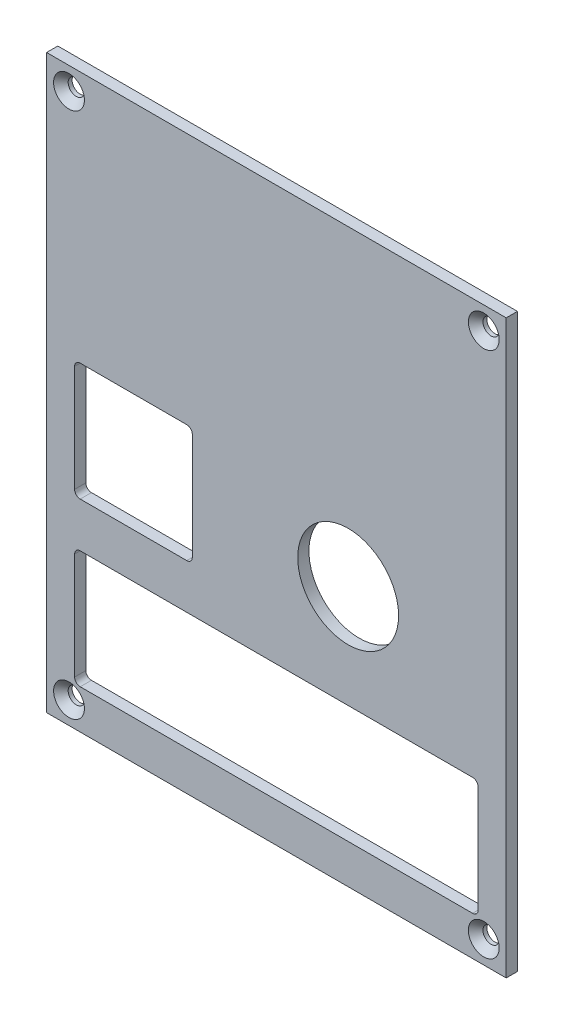
ISO-10303-21;
HEADER;
FILE_DESCRIPTION(('STEP AP214'),'2;1');
FILE_NAME('part.step','',(''),(''),'','','');
FILE_SCHEMA(('AUTOMOTIVE_DESIGN { 1 0 10303 214 1 1 1 1 }'));
ENDSEC;
DATA;
#1=APPLICATION_CONTEXT('core data for automotive mechanical design processes');
#2=APPLICATION_PROTOCOL_DEFINITION('international standard','automotive_design',2000,#1);
#3=PRODUCT_CONTEXT('',#1,'mechanical');
#4=PRODUCT('Part','Part','',(#3));
#5=PRODUCT_RELATED_PRODUCT_CATEGORY('part','',(#4));
#6=PRODUCT_DEFINITION_FORMATION('','',#4);
#7=PRODUCT_DEFINITION_CONTEXT('part definition',#1,'design');
#8=PRODUCT_DEFINITION('design','',#6,#7);
#9=PRODUCT_DEFINITION_SHAPE('','',#8);
#10=(LENGTH_UNIT() NAMED_UNIT(*) SI_UNIT(.MILLI.,.METRE.));
#11=(NAMED_UNIT(*) PLANE_ANGLE_UNIT() SI_UNIT($,.RADIAN.));
#12=(NAMED_UNIT(*) SI_UNIT($,.STERADIAN.) SOLID_ANGLE_UNIT());
#13=UNCERTAINTY_MEASURE_WITH_UNIT(LENGTH_MEASURE(1.E-05),#10,'distance_accuracy_value','');
#14=(GEOMETRIC_REPRESENTATION_CONTEXT(3) GLOBAL_UNCERTAINTY_ASSIGNED_CONTEXT((#13)) GLOBAL_UNIT_ASSIGNED_CONTEXT((#10,
#11,#12)) REPRESENTATION_CONTEXT('',''));
#15=CARTESIAN_POINT('',(0.,0.,0.));
#16=DIRECTION('',(0.,0.,1.));
#17=DIRECTION('',(1.,0.,0.));
#18=AXIS2_PLACEMENT_3D('',#15,#16,#17);
#19=CARTESIAN_POINT('',(-49.4982229940401,55.7269024568216,2.));
#20=DIRECTION('',(1.,0.,0.));
#21=DIRECTION('',(0.,1.,0.));
#22=AXIS2_PLACEMENT_3D('',#19,#20,#21);
#23=PLANE('',#22);
#24=DIRECTION('',(0.,-1.,0.));
#25=VECTOR('',#24,1.);
#26=CARTESIAN_POINT('',(-49.4982229940401,55.7269024568216,0.));
#27=LINE('',#26,#25);
#28=CARTESIAN_POINT('',(-49.4982229940401,55.7269024568216,0.));
#29=VERTEX_POINT('',#28);
#30=CARTESIAN_POINT('',(-49.4982229940401,-46.2730975431784,0.));
#31=VERTEX_POINT('',#30);
#32=EDGE_CURVE('E237',#29,#31,#27,.T.);
#33=ORIENTED_EDGE('',*,*,#32,.T.);
#34=DIRECTION('',(0.,0.,-1.));
#35=VECTOR('',#34,1.);
#36=CARTESIAN_POINT('',(-49.4982229940401,-46.2730975431784,2.));
#37=LINE('',#36,#35);
#38=CARTESIAN_POINT('',(-49.4982229940401,-46.2730975431784,2.));
#39=VERTEX_POINT('',#38);
#40=EDGE_CURVE('E11',#39,#31,#37,.T.);
#41=ORIENTED_EDGE('',*,*,#40,.F.);
#42=DIRECTION('',(0.,-1.,0.));
#43=VECTOR('',#42,1.);
#44=CARTESIAN_POINT('',(-49.4982229940401,55.7269024568216,2.));
#45=LINE('',#44,#43);
#46=CARTESIAN_POINT('',(-49.4982229940401,55.7269024568216,2.));
#47=VERTEX_POINT('',#46);
#48=EDGE_CURVE('E316',#47,#39,#45,.T.);
#49=ORIENTED_EDGE('',*,*,#48,.F.);
#50=DIRECTION('',(0.,0.,-1.));
#51=VECTOR('',#50,1.);
#52=CARTESIAN_POINT('',(-49.4982229940401,55.7269024568216,2.));
#53=LINE('',#52,#51);
#54=EDGE_CURVE('E326',#47,#29,#53,.T.);
#55=ORIENTED_EDGE('',*,*,#54,.T.);
#56=EDGE_LOOP('',(#33,#41,#49,#55));
#57=FACE_BOUND('',#56,.T.);
#58=ADVANCED_FACE('F37',(#57),#23,.F.);
#59=CARTESIAN_POINT('',(-49.4982229940401,-46.2730975431784,2.));
#60=DIRECTION('',(0.,1.,0.));
#61=DIRECTION('',(0.,0.,1.));
#62=AXIS2_PLACEMENT_3D('',#59,#60,#61);
#63=PLANE('',#62);
#64=DIRECTION('',(1.,0.,0.));
#65=VECTOR('',#64,1.);
#66=CARTESIAN_POINT('',(-49.4982229940401,-46.2730975431784,0.));
#67=LINE('',#66,#65);
#68=CARTESIAN_POINT('',(32.5017770059599,-46.2730975431784,0.));
#69=VERTEX_POINT('',#68);
#70=EDGE_CURVE('E329',#31,#69,#67,.T.);
#71=ORIENTED_EDGE('',*,*,#70,.T.);
#72=DIRECTION('',(0.,0.,-1.));
#73=VECTOR('',#72,1.);
#74=CARTESIAN_POINT('',(32.5017770059599,-46.2730975431784,2.));
#75=LINE('',#74,#73);
#76=CARTESIAN_POINT('',(32.5017770059599,-46.2730975431784,2.));
#77=VERTEX_POINT('',#76);
#78=EDGE_CURVE('E44',#77,#69,#75,.T.);
#79=ORIENTED_EDGE('',*,*,#78,.F.);
#80=DIRECTION('',(1.,0.,0.));
#81=VECTOR('',#80,1.);
#82=CARTESIAN_POINT('',(-49.4982229940401,-46.2730975431784,2.));
#83=LINE('',#82,#81);
#84=EDGE_CURVE('E319',#39,#77,#83,.T.);
#85=ORIENTED_EDGE('',*,*,#84,.F.);
#86=ORIENTED_EDGE('',*,*,#40,.T.);
#87=EDGE_LOOP('',(#71,#79,#85,#86));
#88=FACE_BOUND('',#87,.T.);
#89=ADVANCED_FACE('F358',(#88),#63,.F.);
#90=CARTESIAN_POINT('',(32.5017770059599,55.7269024568216,2.));
#91=DIRECTION('',(-1.,0.,0.));
#92=DIRECTION('',(0.,-1.,0.));
#93=AXIS2_PLACEMENT_3D('',#90,#91,#92);
#94=PLANE('',#93);
#95=DIRECTION('',(0.,1.,0.));
#96=VECTOR('',#95,1.);
#97=CARTESIAN_POINT('',(32.5017770059599,55.7269024568216,0.));
#98=LINE('',#97,#96);
#99=CARTESIAN_POINT('',(32.5017770059599,55.7269024568216,0.));
#100=VERTEX_POINT('',#99);
#101=EDGE_CURVE('E331',#69,#100,#98,.T.);
#102=ORIENTED_EDGE('',*,*,#101,.T.);
#103=DIRECTION('',(0.,0.,-1.));
#104=VECTOR('',#103,1.);
#105=CARTESIAN_POINT('',(32.5017770059599,55.7269024568216,2.));
#106=LINE('',#105,#104);
#107=CARTESIAN_POINT('',(32.5017770059599,55.7269024568216,2.));
#108=VERTEX_POINT('',#107);
#109=EDGE_CURVE('E336',#108,#100,#106,.T.);
#110=ORIENTED_EDGE('',*,*,#109,.F.);
#111=DIRECTION('',(0.,1.,0.));
#112=VECTOR('',#111,1.);
#113=CARTESIAN_POINT('',(32.5017770059599,55.7269024568216,2.));
#114=LINE('',#113,#112);
#115=EDGE_CURVE('E322',#77,#108,#114,.T.);
#116=ORIENTED_EDGE('',*,*,#115,.F.);
#117=ORIENTED_EDGE('',*,*,#78,.T.);
#118=EDGE_LOOP('',(#102,#110,#116,#117));
#119=FACE_BOUND('',#118,.T.);
#120=ADVANCED_FACE('F343',(#119),#94,.F.);
#121=CARTESIAN_POINT('',(-49.4982229940401,55.7269024568216,2.));
#122=DIRECTION('',(0.,-1.,0.));
#123=DIRECTION('',(0.,0.,-1.));
#124=AXIS2_PLACEMENT_3D('',#121,#122,#123);
#125=PLANE('',#124);
#126=DIRECTION('',(-1.,0.,0.));
#127=VECTOR('',#126,1.);
#128=CARTESIAN_POINT('',(-49.4982229940401,55.7269024568216,0.));
#129=LINE('',#128,#127);
#130=EDGE_CURVE('E320',#100,#29,#129,.T.);
#131=ORIENTED_EDGE('',*,*,#130,.T.);
#132=ORIENTED_EDGE('',*,*,#54,.F.);
#133=DIRECTION('',(-1.,0.,0.));
#134=VECTOR('',#133,1.);
#135=CARTESIAN_POINT('',(-49.4982229940401,55.7269024568216,2.));
#136=LINE('',#135,#134);
#137=EDGE_CURVE('E324',#108,#47,#136,.T.);
#138=ORIENTED_EDGE('',*,*,#137,.F.);
#139=ORIENTED_EDGE('',*,*,#109,.T.);
#140=EDGE_LOOP('',(#131,#132,#138,#139));
#141=FACE_BOUND('',#140,.T.);
#142=ADVANCED_FACE('F351',(#141),#125,.F.);
#143=CARTESIAN_POINT('',(0.,0.,2.));
#144=DIRECTION('',(0.,0.,1.));
#145=DIRECTION('',(1.,0.,0.));
#146=AXIS2_PLACEMENT_3D('',#143,#144,#145);
#147=PLANE('',#146);
#148=CARTESIAN_POINT('',(-45.4982229940401,51.7269024568216,2.));
#149=DIRECTION('',(0.,0.,1.));
#150=DIRECTION('',(1.,0.,0.));
#151=AXIS2_PLACEMENT_3D('',#148,#149,#150);
#152=CIRCLE('',#151,2.75);
#153=CARTESIAN_POINT('',(-42.7482229940401,51.7269024568216,2.));
#154=VERTEX_POINT('',#153);
#155=EDGE_CURVE('E476',#154,#154,#152,.T.);
#156=ORIENTED_EDGE('',*,*,#155,.F.);
#157=EDGE_LOOP('',(#156));
#158=FACE_BOUND('',#157,.T.);
#159=CARTESIAN_POINT('',(-45.4982229940401,-42.2730975431784,2.));
#160=DIRECTION('',(0.,0.,1.));
#161=DIRECTION('',(1.,0.,0.));
#162=AXIS2_PLACEMENT_3D('',#159,#160,#161);
#163=CIRCLE('',#162,2.75);
#164=CARTESIAN_POINT('',(-42.7482229940401,-42.2730975431784,2.));
#165=VERTEX_POINT('',#164);
#166=EDGE_CURVE('E483',#165,#165,#163,.T.);
#167=ORIENTED_EDGE('',*,*,#166,.F.);
#168=EDGE_LOOP('',(#167));
#169=FACE_BOUND('',#168,.T.);
#170=CARTESIAN_POINT('',(28.5017770059599,-42.2730975431784,2.));
#171=DIRECTION('',(0.,0.,1.));
#172=DIRECTION('',(1.,0.,0.));
#173=AXIS2_PLACEMENT_3D('',#170,#171,#172);
#174=CIRCLE('',#173,2.75);
#175=CARTESIAN_POINT('',(31.2517770059599,-42.2730975431784,2.));
#176=VERTEX_POINT('',#175);
#177=EDGE_CURVE('E492',#176,#176,#174,.T.);
#178=ORIENTED_EDGE('',*,*,#177,.F.);
#179=EDGE_LOOP('',(#178));
#180=FACE_BOUND('',#179,.T.);
#181=CARTESIAN_POINT('',(28.5017770059599,51.7269024568216,2.));
#182=DIRECTION('',(0.,0.,1.));
#183=DIRECTION('',(1.,0.,0.));
#184=AXIS2_PLACEMENT_3D('',#181,#182,#183);
#185=CIRCLE('',#184,2.75);
#186=CARTESIAN_POINT('',(31.2517770059599,51.7269024568216,2.));
#187=VERTEX_POINT('',#186);
#188=EDGE_CURVE('E501',#187,#187,#185,.T.);
#189=ORIENTED_EDGE('',*,*,#188,.F.);
#190=EDGE_LOOP('',(#189));
#191=FACE_BOUND('',#190,.T.);
#192=CARTESIAN_POINT('',(26.5017770059599,-19.2730975431784,2.));
#193=DIRECTION('',(0.,0.,1.));
#194=DIRECTION('',(-1.,0.,0.));
#195=AXIS2_PLACEMENT_3D('',#192,#193,#194);
#196=CIRCLE('',#195,1.);
#197=CARTESIAN_POINT('',(27.5017770059599,-19.2730975431784,2.));
#198=VERTEX_POINT('',#197);
#199=CARTESIAN_POINT('',(26.5017770059599,-18.2730975431784,2.));
#200=VERTEX_POINT('',#199);
#201=EDGE_CURVE('E51',#198,#200,#196,.T.);
#202=ORIENTED_EDGE('',*,*,#201,.F.);
#203=DIRECTION('',(0.,1.,0.));
#204=VECTOR('',#203,1.);
#205=CARTESIAN_POINT('',(27.5017770059599,-19.2730975431784,2.));
#206=LINE('',#205,#204);
#207=CARTESIAN_POINT('',(27.5017770059599,-38.2730975431784,2.));
#208=VERTEX_POINT('',#207);
#209=EDGE_CURVE('E195',#208,#198,#206,.T.);
#210=ORIENTED_EDGE('',*,*,#209,.F.);
#211=CARTESIAN_POINT('',(26.5017770059599,-38.2730975431784,2.));
#212=DIRECTION('',(0.,0.,1.));
#213=DIRECTION('',(1.,0.,0.));
#214=AXIS2_PLACEMENT_3D('',#211,#212,#213);
#215=CIRCLE('',#214,1.);
#216=CARTESIAN_POINT('',(26.5017770059599,-39.2730975431784,2.));
#217=VERTEX_POINT('',#216);
#218=EDGE_CURVE('E198',#217,#208,#215,.T.);
#219=ORIENTED_EDGE('',*,*,#218,.F.);
#220=DIRECTION('',(1.,0.,0.));
#221=VECTOR('',#220,1.);
#222=CARTESIAN_POINT('',(-43.4982229940401,-39.2730975431784,2.));
#223=LINE('',#222,#221);
#224=CARTESIAN_POINT('',(-43.4982229940401,-39.2730975431784,2.));
#225=VERTEX_POINT('',#224);
#226=EDGE_CURVE('E230',#225,#217,#223,.T.);
#227=ORIENTED_EDGE('',*,*,#226,.F.);
#228=CARTESIAN_POINT('',(-43.4982229940401,-38.2730975431784,2.));
#229=DIRECTION('',(0.,0.,1.));
#230=DIRECTION('',(1.,0.,0.));
#231=AXIS2_PLACEMENT_3D('',#228,#229,#230);
#232=CIRCLE('',#231,1.);
#233=CARTESIAN_POINT('',(-44.4982229940401,-38.2730975431784,2.));
#234=VERTEX_POINT('',#233);
#235=EDGE_CURVE('E227',#234,#225,#232,.T.);
#236=ORIENTED_EDGE('',*,*,#235,.F.);
#237=DIRECTION('',(0.,-1.,0.));
#238=VECTOR('',#237,1.);
#239=CARTESIAN_POINT('',(-44.4982229940401,-19.2730975431784,2.));
#240=LINE('',#239,#238);
#241=CARTESIAN_POINT('',(-44.4982229940401,-19.2730975431784,2.));
#242=VERTEX_POINT('',#241);
#243=EDGE_CURVE('E224',#242,#234,#240,.T.);
#244=ORIENTED_EDGE('',*,*,#243,.F.);
#245=CARTESIAN_POINT('',(-43.4982229940401,-19.2730975431784,2.));
#246=DIRECTION('',(0.,0.,1.));
#247=DIRECTION('',(1.,0.,0.));
#248=AXIS2_PLACEMENT_3D('',#245,#246,#247);
#249=CIRCLE('',#248,1.);
#250=CARTESIAN_POINT('',(-43.4982229940401,-18.2730975431784,2.));
#251=VERTEX_POINT('',#250);
#252=EDGE_CURVE('E221',#251,#242,#249,.T.);
#253=ORIENTED_EDGE('',*,*,#252,.F.);
#254=DIRECTION('',(-1.,0.,0.));
#255=VECTOR('',#254,1.);
#256=CARTESIAN_POINT('',(-43.4982229940401,-18.2730975431784,2.));
#257=LINE('',#256,#255);
#258=EDGE_CURVE('E218',#200,#251,#257,.T.);
#259=ORIENTED_EDGE('',*,*,#258,.F.);
#260=EDGE_LOOP('',(#202,#210,#219,#227,#236,#244,#253,#259));
#261=FACE_BOUND('',#260,.T.);
#262=CARTESIAN_POINT('',(-43.4982229940401,-9.27309754317841,2.));
#263=DIRECTION('',(0.,0.,1.));
#264=DIRECTION('',(1.,0.,0.));
#265=AXIS2_PLACEMENT_3D('',#262,#263,#264);
#266=CIRCLE('',#265,1.);
#267=CARTESIAN_POINT('',(-44.4982229940401,-9.27309754317841,2.));
#268=VERTEX_POINT('',#267);
#269=CARTESIAN_POINT('',(-43.4982229940401,-10.2730975431784,2.));
#270=VERTEX_POINT('',#269);
#271=EDGE_CURVE('E59',#268,#270,#266,.T.);
#272=ORIENTED_EDGE('',*,*,#271,.F.);
#273=DIRECTION('',(0.,-1.,0.));
#274=VECTOR('',#273,1.);
#275=CARTESIAN_POINT('',(-44.4982229940401,9.72690245682159,2.));
#276=LINE('',#275,#274);
#277=CARTESIAN_POINT('',(-44.4982229940401,9.72690245682159,2.));
#278=VERTEX_POINT('',#277);
#279=EDGE_CURVE('E253',#278,#268,#276,.T.);
#280=ORIENTED_EDGE('',*,*,#279,.F.);
#281=CARTESIAN_POINT('',(-43.4982229940401,9.72690245682159,2.));
#282=DIRECTION('',(0.,0.,1.));
#283=DIRECTION('',(1.,0.,0.));
#284=AXIS2_PLACEMENT_3D('',#281,#282,#283);
#285=CIRCLE('',#284,1.);
#286=CARTESIAN_POINT('',(-43.4982229940401,10.7269024568216,2.));
#287=VERTEX_POINT('',#286);
#288=EDGE_CURVE('E292',#287,#278,#285,.T.);
#289=ORIENTED_EDGE('',*,*,#288,.F.);
#290=DIRECTION('',(-1.,0.,0.));
#291=VECTOR('',#290,1.);
#292=CARTESIAN_POINT('',(-43.4982229940401,10.7269024568216,2.));
#293=LINE('',#292,#291);
#294=CARTESIAN_POINT('',(-24.4982229940401,10.7269024568216,2.));
#295=VERTEX_POINT('',#294);
#296=EDGE_CURVE('E289',#295,#287,#293,.T.);
#297=ORIENTED_EDGE('',*,*,#296,.F.);
#298=CARTESIAN_POINT('',(-24.4982229940401,9.72690245682159,2.));
#299=DIRECTION('',(0.,0.,1.));
#300=DIRECTION('',(-1.,0.,0.));
#301=AXIS2_PLACEMENT_3D('',#298,#299,#300);
#302=CIRCLE('',#301,1.);
#303=CARTESIAN_POINT('',(-23.4982229940401,9.72690245682159,2.));
#304=VERTEX_POINT('',#303);
#305=EDGE_CURVE('E286',#304,#295,#302,.T.);
#306=ORIENTED_EDGE('',*,*,#305,.F.);
#307=DIRECTION('',(0.,1.,0.));
#308=VECTOR('',#307,1.);
#309=CARTESIAN_POINT('',(-23.4982229940401,9.72690245682159,2.));
#310=LINE('',#309,#308);
#311=CARTESIAN_POINT('',(-23.4982229940401,-9.27309754317841,2.));
#312=VERTEX_POINT('',#311);
#313=EDGE_CURVE('E283',#312,#304,#310,.T.);
#314=ORIENTED_EDGE('',*,*,#313,.F.);
#315=CARTESIAN_POINT('',(-24.4982229940401,-9.27309754317841,2.));
#316=DIRECTION('',(0.,0.,1.));
#317=DIRECTION('',(1.,0.,0.));
#318=AXIS2_PLACEMENT_3D('',#315,#316,#317);
#319=CIRCLE('',#318,1.);
#320=CARTESIAN_POINT('',(-24.4982229940401,-10.2730975431784,2.));
#321=VERTEX_POINT('',#320);
#322=EDGE_CURVE('E280',#321,#312,#319,.T.);
#323=ORIENTED_EDGE('',*,*,#322,.F.);
#324=DIRECTION('',(1.,0.,0.));
#325=VECTOR('',#324,1.);
#326=CARTESIAN_POINT('',(-43.4982229940401,-10.2730975431784,2.));
#327=LINE('',#326,#325);
#328=EDGE_CURVE('E276',#270,#321,#327,.T.);
#329=ORIENTED_EDGE('',*,*,#328,.F.);
#330=EDGE_LOOP('',(#272,#280,#289,#297,#306,#314,#323,#329));
#331=FACE_BOUND('',#330,.T.);
#332=CARTESIAN_POINT('',(4.30178163771792,0.112195323661565,2.));
#333=DIRECTION('',(0.,0.,1.));
#334=DIRECTION('',(1.,0.,0.));
#335=AXIS2_PLACEMENT_3D('',#332,#333,#334);
#336=CIRCLE('',#335,9.00000000000094);
#337=CARTESIAN_POINT('',(13.3017816377189,0.112195323661565,2.));
#338=VERTEX_POINT('',#337);
#339=EDGE_CURVE('E313',#338,#338,#336,.T.);
#340=ORIENTED_EDGE('',*,*,#339,.F.);
#341=EDGE_LOOP('',(#340));
#342=FACE_BOUND('',#341,.T.);
#343=ORIENTED_EDGE('',*,*,#48,.T.);
#344=ORIENTED_EDGE('',*,*,#84,.T.);
#345=ORIENTED_EDGE('',*,*,#115,.T.);
#346=ORIENTED_EDGE('',*,*,#137,.T.);
#347=EDGE_LOOP('',(#343,#344,#345,#346));
#348=FACE_BOUND('',#347,.T.);
#349=ADVANCED_FACE('F357',(#158,#169,#180,#191,#261,#331,#342,#348),#147,.T.);
#350=CARTESIAN_POINT('',(0.,0.,0.));
#351=DIRECTION('',(0.,0.,1.));
#352=DIRECTION('',(1.,0.,0.));
#353=AXIS2_PLACEMENT_3D('',#350,#351,#352);
#354=PLANE('',#353);
#355=CARTESIAN_POINT('',(-45.4982229940401,51.7269024568216,0.));
#356=DIRECTION('',(0.,0.,1.));
#357=DIRECTION('',(1.,0.,0.));
#358=AXIS2_PLACEMENT_3D('',#355,#356,#357);
#359=CIRCLE('',#358,1.45);
#360=CARTESIAN_POINT('',(-44.0482229940401,51.7269024568216,0.));
#361=VERTEX_POINT('',#360);
#362=EDGE_CURVE('E478',#361,#361,#359,.T.);
#363=ORIENTED_EDGE('',*,*,#362,.T.);
#364=EDGE_LOOP('',(#363));
#365=FACE_BOUND('',#364,.T.);
#366=CARTESIAN_POINT('',(-45.4982229940401,-42.2730975431784,0.));
#367=DIRECTION('',(0.,0.,1.));
#368=DIRECTION('',(1.,0.,0.));
#369=AXIS2_PLACEMENT_3D('',#366,#367,#368);
#370=CIRCLE('',#369,1.45);
#371=CARTESIAN_POINT('',(-44.0482229940401,-42.2730975431784,0.));
#372=VERTEX_POINT('',#371);
#373=EDGE_CURVE('E489',#372,#372,#370,.T.);
#374=ORIENTED_EDGE('',*,*,#373,.T.);
#375=EDGE_LOOP('',(#374));
#376=FACE_BOUND('',#375,.T.);
#377=CARTESIAN_POINT('',(28.5017770059599,-42.2730975431784,0.));
#378=DIRECTION('',(0.,0.,1.));
#379=DIRECTION('',(1.,0.,0.));
#380=AXIS2_PLACEMENT_3D('',#377,#378,#379);
#381=CIRCLE('',#380,1.45);
#382=CARTESIAN_POINT('',(29.9517770059599,-42.2730975431784,0.));
#383=VERTEX_POINT('',#382);
#384=EDGE_CURVE('E498',#383,#383,#381,.T.);
#385=ORIENTED_EDGE('',*,*,#384,.T.);
#386=EDGE_LOOP('',(#385));
#387=FACE_BOUND('',#386,.T.);
#388=CARTESIAN_POINT('',(28.5017770059599,51.7269024568216,0.));
#389=DIRECTION('',(0.,0.,1.));
#390=DIRECTION('',(1.,0.,0.));
#391=AXIS2_PLACEMENT_3D('',#388,#389,#390);
#392=CIRCLE('',#391,1.45);
#393=CARTESIAN_POINT('',(29.9517770059599,51.7269024568216,0.));
#394=VERTEX_POINT('',#393);
#395=EDGE_CURVE('E201',#394,#394,#392,.T.);
#396=ORIENTED_EDGE('',*,*,#395,.T.);
#397=EDGE_LOOP('',(#396));
#398=FACE_BOUND('',#397,.T.);
#399=DIRECTION('',(0.,1.,0.));
#400=VECTOR('',#399,1.);
#401=CARTESIAN_POINT('',(27.5017770059599,-19.2730975431784,0.));
#402=LINE('',#401,#400);
#403=CARTESIAN_POINT('',(27.5017770059599,-38.2730975431784,0.));
#404=VERTEX_POINT('',#403);
#405=CARTESIAN_POINT('',(27.5017770059599,-19.2730975431784,0.));
#406=VERTEX_POINT('',#405);
#407=EDGE_CURVE('E181',#404,#406,#402,.T.);
#408=ORIENTED_EDGE('',*,*,#407,.T.);
#409=CARTESIAN_POINT('',(26.5017770059599,-19.2730975431784,0.));
#410=DIRECTION('',(0.,0.,1.));
#411=DIRECTION('',(-1.,0.,0.));
#412=AXIS2_PLACEMENT_3D('',#409,#410,#411);
#413=CIRCLE('',#412,1.);
#414=CARTESIAN_POINT('',(26.5017770059599,-18.2730975431784,0.));
#415=VERTEX_POINT('',#414);
#416=EDGE_CURVE('E175',#406,#415,#413,.T.);
#417=ORIENTED_EDGE('',*,*,#416,.T.);
#418=DIRECTION('',(-1.,0.,0.));
#419=VECTOR('',#418,1.);
#420=CARTESIAN_POINT('',(-43.4982229940401,-18.2730975431784,0.));
#421=LINE('',#420,#419);
#422=CARTESIAN_POINT('',(-43.4982229940401,-18.2730975431784,0.));
#423=VERTEX_POINT('',#422);
#424=EDGE_CURVE('E185',#415,#423,#421,.T.);
#425=ORIENTED_EDGE('',*,*,#424,.T.);
#426=CARTESIAN_POINT('',(-43.4982229940401,-19.2730975431784,0.));
#427=DIRECTION('',(0.,0.,1.));
#428=DIRECTION('',(1.,0.,0.));
#429=AXIS2_PLACEMENT_3D('',#426,#427,#428);
#430=CIRCLE('',#429,1.);
#431=CARTESIAN_POINT('',(-44.4982229940401,-19.2730975431784,0.));
#432=VERTEX_POINT('',#431);
#433=EDGE_CURVE('E189',#423,#432,#430,.T.);
#434=ORIENTED_EDGE('',*,*,#433,.T.);
#435=DIRECTION('',(0.,-1.,0.));
#436=VECTOR('',#435,1.);
#437=CARTESIAN_POINT('',(-44.4982229940401,-19.2730975431784,0.));
#438=LINE('',#437,#436);
#439=CARTESIAN_POINT('',(-44.4982229940401,-38.2730975431784,0.));
#440=VERTEX_POINT('',#439);
#441=EDGE_CURVE('E205',#432,#440,#438,.T.);
#442=ORIENTED_EDGE('',*,*,#441,.T.);
#443=CARTESIAN_POINT('',(-43.4982229940401,-38.2730975431784,0.));
#444=DIRECTION('',(0.,0.,1.));
#445=DIRECTION('',(1.,0.,0.));
#446=AXIS2_PLACEMENT_3D('',#443,#444,#445);
#447=CIRCLE('',#446,1.);
#448=CARTESIAN_POINT('',(-43.4982229940401,-39.2730975431784,0.));
#449=VERTEX_POINT('',#448);
#450=EDGE_CURVE('E208',#440,#449,#447,.T.);
#451=ORIENTED_EDGE('',*,*,#450,.T.);
#452=DIRECTION('',(1.,0.,0.));
#453=VECTOR('',#452,1.);
#454=CARTESIAN_POINT('',(-43.4982229940401,-39.2730975431784,0.));
#455=LINE('',#454,#453);
#456=CARTESIAN_POINT('',(26.5017770059599,-39.2730975431784,0.));
#457=VERTEX_POINT('',#456);
#458=EDGE_CURVE('E211',#449,#457,#455,.T.);
#459=ORIENTED_EDGE('',*,*,#458,.T.);
#460=CARTESIAN_POINT('',(26.5017770059599,-38.2730975431784,0.));
#461=DIRECTION('',(0.,0.,1.));
#462=DIRECTION('',(1.,0.,0.));
#463=AXIS2_PLACEMENT_3D('',#460,#461,#462);
#464=CIRCLE('',#463,1.);
#465=EDGE_CURVE('E214',#457,#404,#464,.T.);
#466=ORIENTED_EDGE('',*,*,#465,.T.);
#467=EDGE_LOOP('',(#408,#417,#425,#434,#442,#451,#459,#466));
#468=FACE_BOUND('',#467,.T.);
#469=DIRECTION('',(0.,-1.,0.));
#470=VECTOR('',#469,1.);
#471=CARTESIAN_POINT('',(-44.4982229940401,9.72690245682159,0.));
#472=LINE('',#471,#470);
#473=CARTESIAN_POINT('',(-44.4982229940401,9.72690245682159,0.));
#474=VERTEX_POINT('',#473);
#475=CARTESIAN_POINT('',(-44.4982229940401,-9.27309754317841,0.));
#476=VERTEX_POINT('',#475);
#477=EDGE_CURVE('E271',#474,#476,#472,.T.);
#478=ORIENTED_EDGE('',*,*,#477,.T.);
#479=CARTESIAN_POINT('',(-43.4982229940401,-9.27309754317841,0.));
#480=DIRECTION('',(0.,0.,1.));
#481=DIRECTION('',(1.,0.,0.));
#482=AXIS2_PLACEMENT_3D('',#479,#480,#481);
#483=CIRCLE('',#482,1.);
#484=CARTESIAN_POINT('',(-43.4982229940401,-10.2730975431784,0.));
#485=VERTEX_POINT('',#484);
#486=EDGE_CURVE('E249',#476,#485,#483,.T.);
#487=ORIENTED_EDGE('',*,*,#486,.T.);
#488=DIRECTION('',(1.,0.,0.));
#489=VECTOR('',#488,1.);
#490=CARTESIAN_POINT('',(-43.4982229940401,-10.2730975431784,0.));
#491=LINE('',#490,#489);
#492=CARTESIAN_POINT('',(-24.4982229940401,-10.2730975431784,0.));
#493=VERTEX_POINT('',#492);
#494=EDGE_CURVE('E252',#485,#493,#491,.T.);
#495=ORIENTED_EDGE('',*,*,#494,.T.);
#496=CARTESIAN_POINT('',(-24.4982229940401,-9.27309754317841,0.));
#497=DIRECTION('',(0.,0.,1.));
#498=DIRECTION('',(1.,0.,0.));
#499=AXIS2_PLACEMENT_3D('',#496,#497,#498);
#500=CIRCLE('',#499,1.);
#501=CARTESIAN_POINT('',(-23.4982229940401,-9.27309754317841,0.));
#502=VERTEX_POINT('',#501);
#503=EDGE_CURVE('E256',#493,#502,#500,.T.);
#504=ORIENTED_EDGE('',*,*,#503,.T.);
#505=DIRECTION('',(0.,1.,0.));
#506=VECTOR('',#505,1.);
#507=CARTESIAN_POINT('',(-23.4982229940401,9.72690245682159,0.));
#508=LINE('',#507,#506);
#509=CARTESIAN_POINT('',(-23.4982229940401,9.72690245682159,0.));
#510=VERTEX_POINT('',#509);
#511=EDGE_CURVE('E259',#502,#510,#508,.T.);
#512=ORIENTED_EDGE('',*,*,#511,.T.);
#513=CARTESIAN_POINT('',(-24.4982229940401,9.72690245682159,0.));
#514=DIRECTION('',(0.,0.,1.));
#515=DIRECTION('',(-1.,0.,0.));
#516=AXIS2_PLACEMENT_3D('',#513,#514,#515);
#517=CIRCLE('',#516,1.);
#518=CARTESIAN_POINT('',(-24.4982229940401,10.7269024568216,0.));
#519=VERTEX_POINT('',#518);
#520=EDGE_CURVE('E262',#510,#519,#517,.T.);
#521=ORIENTED_EDGE('',*,*,#520,.T.);
#522=DIRECTION('',(-1.,0.,0.));
#523=VECTOR('',#522,1.);
#524=CARTESIAN_POINT('',(-43.4982229940401,10.7269024568216,0.));
#525=LINE('',#524,#523);
#526=CARTESIAN_POINT('',(-43.4982229940401,10.7269024568216,0.));
#527=VERTEX_POINT('',#526);
#528=EDGE_CURVE('E265',#519,#527,#525,.T.);
#529=ORIENTED_EDGE('',*,*,#528,.T.);
#530=CARTESIAN_POINT('',(-43.4982229940401,9.72690245682159,0.));
#531=DIRECTION('',(0.,0.,1.));
#532=DIRECTION('',(1.,0.,0.));
#533=AXIS2_PLACEMENT_3D('',#530,#531,#532);
#534=CIRCLE('',#533,1.);
#535=EDGE_CURVE('E268',#527,#474,#534,.T.);
#536=ORIENTED_EDGE('',*,*,#535,.T.);
#537=EDGE_LOOP('',(#478,#487,#495,#504,#512,#521,#529,#536));
#538=FACE_BOUND('',#537,.T.);
#539=CARTESIAN_POINT('',(4.30178163771792,0.112195323661565,0.));
#540=DIRECTION('',(0.,0.,1.));
#541=DIRECTION('',(1.,0.,0.));
#542=AXIS2_PLACEMENT_3D('',#539,#540,#541);
#543=CIRCLE('',#542,9.00000000000094);
#544=CARTESIAN_POINT('',(13.3017816377189,0.112195323661565,0.));
#545=VERTEX_POINT('',#544);
#546=EDGE_CURVE('E277',#545,#545,#543,.T.);
#547=ORIENTED_EDGE('',*,*,#546,.T.);
#548=EDGE_LOOP('',(#547));
#549=FACE_BOUND('',#548,.T.);
#550=ORIENTED_EDGE('',*,*,#32,.F.);
#551=ORIENTED_EDGE('',*,*,#130,.F.);
#552=ORIENTED_EDGE('',*,*,#101,.F.);
#553=ORIENTED_EDGE('',*,*,#70,.F.);
#554=EDGE_LOOP('',(#550,#551,#552,#553));
#555=FACE_BOUND('',#554,.T.);
#556=ADVANCED_FACE('F191',(#365,#376,#387,#398,#468,#538,#549,#555),#354,.F.);
#557=CARTESIAN_POINT('',(4.30178163771792,0.112195323661565,0.));
#558=DIRECTION('',(0.,0.,1.));
#559=DIRECTION('',(1.,0.,0.));
#560=AXIS2_PLACEMENT_3D('',#557,#558,#559);
#561=CYLINDRICAL_SURFACE('',#560,9.00000000000094);
#562=ORIENTED_EDGE('',*,*,#546,.F.);
#563=EDGE_LOOP('',(#562));
#564=FACE_BOUND('',#563,.T.);
#565=ORIENTED_EDGE('',*,*,#339,.T.);
#566=EDGE_LOOP('',(#565));
#567=FACE_BOUND('',#566,.T.);
#568=ADVANCED_FACE('F370',(#564,#567),#561,.F.);
#569=CARTESIAN_POINT('',(-43.4982229940401,-9.27309754317841,0.));
#570=DIRECTION('',(0.,0.,1.));
#571=DIRECTION('',(1.,0.,0.));
#572=AXIS2_PLACEMENT_3D('',#569,#570,#571);
#573=CYLINDRICAL_SURFACE('',#572,1.);
#574=ORIENTED_EDGE('',*,*,#271,.T.);
#575=DIRECTION('',(0.,0.,1.));
#576=VECTOR('',#575,1.);
#577=CARTESIAN_POINT('',(-43.4982229940401,-10.2730975431784,0.));
#578=LINE('',#577,#576);
#579=EDGE_CURVE('E274',#485,#270,#578,.T.);
#580=ORIENTED_EDGE('',*,*,#579,.F.);
#581=ORIENTED_EDGE('',*,*,#486,.F.);
#582=DIRECTION('',(0.,0.,1.));
#583=VECTOR('',#582,1.);
#584=CARTESIAN_POINT('',(-44.4982229940401,-9.27309754317841,0.));
#585=LINE('',#584,#583);
#586=EDGE_CURVE('E219',#476,#268,#585,.T.);
#587=ORIENTED_EDGE('',*,*,#586,.T.);
#588=EDGE_LOOP('',(#574,#580,#581,#587));
#589=FACE_BOUND('',#588,.T.);
#590=ADVANCED_FACE('F377',(#589),#573,.F.);
#591=CARTESIAN_POINT('',(-44.4982229940401,9.72690245682159,0.));
#592=DIRECTION('',(-1.,0.,0.));
#593=DIRECTION('',(0.,0.,1.));
#594=AXIS2_PLACEMENT_3D('',#591,#592,#593);
#595=PLANE('',#594);
#596=ORIENTED_EDGE('',*,*,#279,.T.);
#597=ORIENTED_EDGE('',*,*,#586,.F.);
#598=ORIENTED_EDGE('',*,*,#477,.F.);
#599=DIRECTION('',(0.,0.,1.));
#600=VECTOR('',#599,1.);
#601=CARTESIAN_POINT('',(-44.4982229940401,9.72690245682159,0.));
#602=LINE('',#601,#600);
#603=EDGE_CURVE('E298',#474,#278,#602,.T.);
#604=ORIENTED_EDGE('',*,*,#603,.T.);
#605=EDGE_LOOP('',(#596,#597,#598,#604));
#606=FACE_BOUND('',#605,.T.);
#607=ADVANCED_FACE('F381',(#606),#595,.F.);
#608=CARTESIAN_POINT('',(-43.4982229940401,9.72690245682159,0.));
#609=DIRECTION('',(0.,0.,1.));
#610=DIRECTION('',(1.,0.,0.));
#611=AXIS2_PLACEMENT_3D('',#608,#609,#610);
#612=CYLINDRICAL_SURFACE('',#611,1.);
#613=ORIENTED_EDGE('',*,*,#288,.T.);
#614=ORIENTED_EDGE('',*,*,#603,.F.);
#615=ORIENTED_EDGE('',*,*,#535,.F.);
#616=DIRECTION('',(0.,0.,1.));
#617=VECTOR('',#616,1.);
#618=CARTESIAN_POINT('',(-43.4982229940401,10.7269024568216,0.));
#619=LINE('',#618,#617);
#620=EDGE_CURVE('E300',#527,#287,#619,.T.);
#621=ORIENTED_EDGE('',*,*,#620,.T.);
#622=EDGE_LOOP('',(#613,#614,#615,#621));
#623=FACE_BOUND('',#622,.T.);
#624=ADVANCED_FACE('F401',(#623),#612,.F.);
#625=CARTESIAN_POINT('',(-43.4982229940401,10.7269024568216,0.));
#626=DIRECTION('',(0.,1.,0.));
#627=DIRECTION('',(0.,0.,1.));
#628=AXIS2_PLACEMENT_3D('',#625,#626,#627);
#629=PLANE('',#628);
#630=ORIENTED_EDGE('',*,*,#296,.T.);
#631=ORIENTED_EDGE('',*,*,#620,.F.);
#632=ORIENTED_EDGE('',*,*,#528,.F.);
#633=DIRECTION('',(0.,0.,1.));
#634=VECTOR('',#633,1.);
#635=CARTESIAN_POINT('',(-24.4982229940401,10.7269024568216,0.));
#636=LINE('',#635,#634);
#637=EDGE_CURVE('E302',#519,#295,#636,.T.);
#638=ORIENTED_EDGE('',*,*,#637,.T.);
#639=EDGE_LOOP('',(#630,#631,#632,#638));
#640=FACE_BOUND('',#639,.T.);
#641=ADVANCED_FACE('F397',(#640),#629,.F.);
#642=CARTESIAN_POINT('',(-24.4982229940401,9.72690245682159,0.));
#643=DIRECTION('',(0.,0.,1.));
#644=DIRECTION('',(1.,0.,0.));
#645=AXIS2_PLACEMENT_3D('',#642,#643,#644);
#646=CYLINDRICAL_SURFACE('',#645,1.);
#647=ORIENTED_EDGE('',*,*,#305,.T.);
#648=ORIENTED_EDGE('',*,*,#637,.F.);
#649=ORIENTED_EDGE('',*,*,#520,.F.);
#650=DIRECTION('',(0.,0.,1.));
#651=VECTOR('',#650,1.);
#652=CARTESIAN_POINT('',(-23.4982229940401,9.72690245682159,0.));
#653=LINE('',#652,#651);
#654=EDGE_CURVE('E304',#510,#304,#653,.T.);
#655=ORIENTED_EDGE('',*,*,#654,.T.);
#656=EDGE_LOOP('',(#647,#648,#649,#655));
#657=FACE_BOUND('',#656,.T.);
#658=ADVANCED_FACE('F393',(#657),#646,.F.);
#659=CARTESIAN_POINT('',(-23.4982229940401,9.72690245682159,0.));
#660=DIRECTION('',(1.,0.,0.));
#661=DIRECTION('',(0.,1.,0.));
#662=AXIS2_PLACEMENT_3D('',#659,#660,#661);
#663=PLANE('',#662);
#664=ORIENTED_EDGE('',*,*,#313,.T.);
#665=ORIENTED_EDGE('',*,*,#654,.F.);
#666=ORIENTED_EDGE('',*,*,#511,.F.);
#667=DIRECTION('',(0.,0.,1.));
#668=VECTOR('',#667,1.);
#669=CARTESIAN_POINT('',(-23.4982229940401,-9.27309754317841,0.));
#670=LINE('',#669,#668);
#671=EDGE_CURVE('E306',#502,#312,#670,.T.);
#672=ORIENTED_EDGE('',*,*,#671,.T.);
#673=EDGE_LOOP('',(#664,#665,#666,#672));
#674=FACE_BOUND('',#673,.T.);
#675=ADVANCED_FACE('F389',(#674),#663,.F.);
#676=CARTESIAN_POINT('',(-24.4982229940401,-9.27309754317841,0.));
#677=DIRECTION('',(0.,0.,1.));
#678=DIRECTION('',(1.,0.,0.));
#679=AXIS2_PLACEMENT_3D('',#676,#677,#678);
#680=CYLINDRICAL_SURFACE('',#679,1.);
#681=ORIENTED_EDGE('',*,*,#322,.T.);
#682=ORIENTED_EDGE('',*,*,#671,.F.);
#683=ORIENTED_EDGE('',*,*,#503,.F.);
#684=DIRECTION('',(0.,0.,1.));
#685=VECTOR('',#684,1.);
#686=CARTESIAN_POINT('',(-24.4982229940401,-10.2730975431784,0.));
#687=LINE('',#686,#685);
#688=EDGE_CURVE('E308',#493,#321,#687,.T.);
#689=ORIENTED_EDGE('',*,*,#688,.T.);
#690=EDGE_LOOP('',(#681,#682,#683,#689));
#691=FACE_BOUND('',#690,.T.);
#692=ADVANCED_FACE('F385',(#691),#680,.F.);
#693=CARTESIAN_POINT('',(-43.4982229940401,-10.2730975431784,0.));
#694=DIRECTION('',(0.,-1.,0.));
#695=DIRECTION('',(0.,0.,-1.));
#696=AXIS2_PLACEMENT_3D('',#693,#694,#695);
#697=PLANE('',#696);
#698=ORIENTED_EDGE('',*,*,#328,.T.);
#699=ORIENTED_EDGE('',*,*,#688,.F.);
#700=ORIENTED_EDGE('',*,*,#494,.F.);
#701=ORIENTED_EDGE('',*,*,#579,.T.);
#702=EDGE_LOOP('',(#698,#699,#700,#701));
#703=FACE_BOUND('',#702,.T.);
#704=ADVANCED_FACE('F382',(#703),#697,.F.);
#705=CARTESIAN_POINT('',(26.5017770059599,-19.2730975431784,0.));
#706=DIRECTION('',(0.,0.,1.));
#707=DIRECTION('',(1.,0.,0.));
#708=AXIS2_PLACEMENT_3D('',#705,#706,#707);
#709=CYLINDRICAL_SURFACE('',#708,1.);
#710=ORIENTED_EDGE('',*,*,#201,.T.);
#711=DIRECTION('',(0.,0.,1.));
#712=VECTOR('',#711,1.);
#713=CARTESIAN_POINT('',(26.5017770059599,-18.2730975431784,0.));
#714=LINE('',#713,#712);
#715=EDGE_CURVE('E171',#415,#200,#714,.T.);
#716=ORIENTED_EDGE('',*,*,#715,.F.);
#717=ORIENTED_EDGE('',*,*,#416,.F.);
#718=DIRECTION('',(0.,0.,1.));
#719=VECTOR('',#718,1.);
#720=CARTESIAN_POINT('',(27.5017770059599,-19.2730975431784,0.));
#721=LINE('',#720,#719);
#722=EDGE_CURVE('E235',#406,#198,#721,.T.);
#723=ORIENTED_EDGE('',*,*,#722,.T.);
#724=EDGE_LOOP('',(#710,#716,#717,#723));
#725=FACE_BOUND('',#724,.T.);
#726=ADVANCED_FACE('F173',(#725),#709,.F.);
#727=CARTESIAN_POINT('',(27.5017770059599,-19.2730975431784,0.));
#728=DIRECTION('',(1.,0.,0.));
#729=DIRECTION('',(0.,0.,-1.));
#730=AXIS2_PLACEMENT_3D('',#727,#728,#729);
#731=PLANE('',#730);
#732=ORIENTED_EDGE('',*,*,#209,.T.);
#733=ORIENTED_EDGE('',*,*,#722,.F.);
#734=ORIENTED_EDGE('',*,*,#407,.F.);
#735=DIRECTION('',(0.,0.,1.));
#736=VECTOR('',#735,1.);
#737=CARTESIAN_POINT('',(27.5017770059599,-38.2730975431784,0.));
#738=LINE('',#737,#736);
#739=EDGE_CURVE('E238',#404,#208,#738,.T.);
#740=ORIENTED_EDGE('',*,*,#739,.T.);
#741=EDGE_LOOP('',(#732,#733,#734,#740));
#742=FACE_BOUND('',#741,.T.);
#743=ADVANCED_FACE('F411',(#742),#731,.F.);
#744=CARTESIAN_POINT('',(26.5017770059599,-38.2730975431784,0.));
#745=DIRECTION('',(0.,0.,1.));
#746=DIRECTION('',(1.,0.,0.));
#747=AXIS2_PLACEMENT_3D('',#744,#745,#746);
#748=CYLINDRICAL_SURFACE('',#747,1.);
#749=ORIENTED_EDGE('',*,*,#218,.T.);
#750=ORIENTED_EDGE('',*,*,#739,.F.);
#751=ORIENTED_EDGE('',*,*,#465,.F.);
#752=DIRECTION('',(0.,0.,1.));
#753=VECTOR('',#752,1.);
#754=CARTESIAN_POINT('',(26.5017770059599,-39.2730975431784,0.));
#755=LINE('',#754,#753);
#756=EDGE_CURVE('E240',#457,#217,#755,.T.);
#757=ORIENTED_EDGE('',*,*,#756,.T.);
#758=EDGE_LOOP('',(#749,#750,#751,#757));
#759=FACE_BOUND('',#758,.T.);
#760=ADVANCED_FACE('F430',(#759),#748,.F.);
#761=CARTESIAN_POINT('',(-43.4982229940401,-39.2730975431784,0.));
#762=DIRECTION('',(0.,-1.,0.));
#763=DIRECTION('',(0.,0.,-1.));
#764=AXIS2_PLACEMENT_3D('',#761,#762,#763);
#765=PLANE('',#764);
#766=ORIENTED_EDGE('',*,*,#226,.T.);
#767=ORIENTED_EDGE('',*,*,#756,.F.);
#768=ORIENTED_EDGE('',*,*,#458,.F.);
#769=DIRECTION('',(0.,0.,1.));
#770=VECTOR('',#769,1.);
#771=CARTESIAN_POINT('',(-43.4982229940401,-39.2730975431784,0.));
#772=LINE('',#771,#770);
#773=EDGE_CURVE('E242',#449,#225,#772,.T.);
#774=ORIENTED_EDGE('',*,*,#773,.T.);
#775=EDGE_LOOP('',(#766,#767,#768,#774));
#776=FACE_BOUND('',#775,.T.);
#777=ADVANCED_FACE('F426',(#776),#765,.F.);
#778=CARTESIAN_POINT('',(-43.4982229940401,-38.2730975431784,0.));
#779=DIRECTION('',(0.,0.,1.));
#780=DIRECTION('',(1.,0.,0.));
#781=AXIS2_PLACEMENT_3D('',#778,#779,#780);
#782=CYLINDRICAL_SURFACE('',#781,1.);
#783=ORIENTED_EDGE('',*,*,#235,.T.);
#784=ORIENTED_EDGE('',*,*,#773,.F.);
#785=ORIENTED_EDGE('',*,*,#450,.F.);
#786=DIRECTION('',(0.,0.,1.));
#787=VECTOR('',#786,1.);
#788=CARTESIAN_POINT('',(-44.4982229940401,-38.2730975431784,0.));
#789=LINE('',#788,#787);
#790=EDGE_CURVE('E244',#440,#234,#789,.T.);
#791=ORIENTED_EDGE('',*,*,#790,.T.);
#792=EDGE_LOOP('',(#783,#784,#785,#791));
#793=FACE_BOUND('',#792,.T.);
#794=ADVANCED_FACE('F422',(#793),#782,.F.);
#795=CARTESIAN_POINT('',(-44.4982229940401,-19.2730975431784,0.));
#796=DIRECTION('',(-1.,0.,0.));
#797=DIRECTION('',(0.,0.,1.));
#798=AXIS2_PLACEMENT_3D('',#795,#796,#797);
#799=PLANE('',#798);
#800=ORIENTED_EDGE('',*,*,#243,.T.);
#801=ORIENTED_EDGE('',*,*,#790,.F.);
#802=ORIENTED_EDGE('',*,*,#441,.F.);
#803=DIRECTION('',(0.,0.,1.));
#804=VECTOR('',#803,1.);
#805=CARTESIAN_POINT('',(-44.4982229940401,-19.2730975431784,0.));
#806=LINE('',#805,#804);
#807=EDGE_CURVE('E246',#432,#242,#806,.T.);
#808=ORIENTED_EDGE('',*,*,#807,.T.);
#809=EDGE_LOOP('',(#800,#801,#802,#808));
#810=FACE_BOUND('',#809,.T.);
#811=ADVANCED_FACE('F418',(#810),#799,.F.);
#812=CARTESIAN_POINT('',(-43.4982229940401,-19.2730975431784,0.));
#813=DIRECTION('',(0.,0.,1.));
#814=DIRECTION('',(1.,0.,0.));
#815=AXIS2_PLACEMENT_3D('',#812,#813,#814);
#816=CYLINDRICAL_SURFACE('',#815,1.);
#817=ORIENTED_EDGE('',*,*,#252,.T.);
#818=ORIENTED_EDGE('',*,*,#807,.F.);
#819=ORIENTED_EDGE('',*,*,#433,.F.);
#820=DIRECTION('',(0.,0.,1.));
#821=VECTOR('',#820,1.);
#822=CARTESIAN_POINT('',(-43.4982229940401,-18.2730975431784,0.));
#823=LINE('',#822,#821);
#824=EDGE_CURVE('E180',#423,#251,#823,.T.);
#825=ORIENTED_EDGE('',*,*,#824,.T.);
#826=EDGE_LOOP('',(#817,#818,#819,#825));
#827=FACE_BOUND('',#826,.T.);
#828=ADVANCED_FACE('F415',(#827),#816,.F.);
#829=CARTESIAN_POINT('',(-43.4982229940401,-18.2730975431784,0.));
#830=DIRECTION('',(0.,1.,0.));
#831=DIRECTION('',(0.,0.,1.));
#832=AXIS2_PLACEMENT_3D('',#829,#830,#831);
#833=PLANE('',#832);
#834=ORIENTED_EDGE('',*,*,#258,.T.);
#835=ORIENTED_EDGE('',*,*,#824,.F.);
#836=ORIENTED_EDGE('',*,*,#424,.F.);
#837=ORIENTED_EDGE('',*,*,#715,.T.);
#838=EDGE_LOOP('',(#834,#835,#836,#837));
#839=FACE_BOUND('',#838,.T.);
#840=ADVANCED_FACE('F186',(#839),#833,.F.);
#841=CARTESIAN_POINT('',(28.5017770059599,51.7269024568216,2.));
#842=DIRECTION('',(0.,0.,1.));
#843=DIRECTION('',(1.,0.,0.));
#844=AXIS2_PLACEMENT_3D('',#841,#842,#843);
#845=CYLINDRICAL_SURFACE('',#844,1.44999999999999);
#846=ORIENTED_EDGE('',*,*,#395,.F.);
#847=EDGE_LOOP('',(#846));
#848=FACE_BOUND('',#847,.T.);
#849=CARTESIAN_POINT('',(28.5017770059599,51.7269024568216,0.699999999999991));
#850=DIRECTION('',(0.,0.,1.));
#851=DIRECTION('',(1.,0.,0.));
#852=AXIS2_PLACEMENT_3D('',#849,#850,#851);
#853=CIRCLE('',#852,1.44999999999999);
#854=CARTESIAN_POINT('',(29.9517770059599,51.7269024568216,0.699999999999991));
#855=VERTEX_POINT('',#854);
#856=EDGE_CURVE('E503',#855,#855,#853,.T.);
#857=ORIENTED_EDGE('',*,*,#856,.T.);
#858=EDGE_LOOP('',(#857));
#859=FACE_BOUND('',#858,.T.);
#860=ADVANCED_FACE('F414',(#848,#859),#845,.F.);
#861=CARTESIAN_POINT('',(28.5017770059599,51.7269024568216,2.));
#862=DIRECTION('',(0.,0.,1.));
#863=DIRECTION('',(1.,0.,0.));
#864=AXIS2_PLACEMENT_3D('',#861,#862,#863);
#865=CONICAL_SURFACE('',#864,2.75,0.785398163397448);
#866=ORIENTED_EDGE('',*,*,#856,.F.);
#867=EDGE_LOOP('',(#866));
#868=FACE_BOUND('',#867,.T.);
#869=ORIENTED_EDGE('',*,*,#188,.T.);
#870=EDGE_LOOP('',(#869));
#871=FACE_BOUND('',#870,.T.);
#872=ADVANCED_FACE('F440',(#868,#871),#865,.F.);
#873=CARTESIAN_POINT('',(28.5017770059599,-42.2730975431784,2.));
#874=DIRECTION('',(0.,0.,1.));
#875=DIRECTION('',(1.,0.,0.));
#876=AXIS2_PLACEMENT_3D('',#873,#874,#875);
#877=CYLINDRICAL_SURFACE('',#876,1.44999999999999);
#878=ORIENTED_EDGE('',*,*,#384,.F.);
#879=EDGE_LOOP('',(#878));
#880=FACE_BOUND('',#879,.T.);
#881=CARTESIAN_POINT('',(28.5017770059599,-42.2730975431784,0.699999999999991));
#882=DIRECTION('',(0.,0.,1.));
#883=DIRECTION('',(1.,0.,0.));
#884=AXIS2_PLACEMENT_3D('',#881,#882,#883);
#885=CIRCLE('',#884,1.44999999999999);
#886=CARTESIAN_POINT('',(29.9517770059599,-42.2730975431784,0.699999999999991));
#887=VERTEX_POINT('',#886);
#888=EDGE_CURVE('E495',#887,#887,#885,.T.);
#889=ORIENTED_EDGE('',*,*,#888,.T.);
#890=EDGE_LOOP('',(#889));
#891=FACE_BOUND('',#890,.T.);
#892=ADVANCED_FACE('F444',(#880,#891),#877,.F.);
#893=CARTESIAN_POINT('',(28.5017770059599,-42.2730975431784,2.));
#894=DIRECTION('',(0.,0.,1.));
#895=DIRECTION('',(1.,0.,0.));
#896=AXIS2_PLACEMENT_3D('',#893,#894,#895);
#897=CONICAL_SURFACE('',#896,2.75,0.785398163397448);
#898=ORIENTED_EDGE('',*,*,#888,.F.);
#899=EDGE_LOOP('',(#898));
#900=FACE_BOUND('',#899,.T.);
#901=ORIENTED_EDGE('',*,*,#177,.T.);
#902=EDGE_LOOP('',(#901));
#903=FACE_BOUND('',#902,.T.);
#904=ADVANCED_FACE('F448',(#900,#903),#897,.F.);
#905=CARTESIAN_POINT('',(-45.4982229940401,-42.2730975431784,2.));
#906=DIRECTION('',(0.,0.,1.));
#907=DIRECTION('',(1.,0.,0.));
#908=AXIS2_PLACEMENT_3D('',#905,#906,#907);
#909=CYLINDRICAL_SURFACE('',#908,1.44999999999999);
#910=ORIENTED_EDGE('',*,*,#373,.F.);
#911=EDGE_LOOP('',(#910));
#912=FACE_BOUND('',#911,.T.);
#913=CARTESIAN_POINT('',(-45.4982229940401,-42.2730975431784,0.699999999999991));
#914=DIRECTION('',(0.,0.,1.));
#915=DIRECTION('',(1.,0.,0.));
#916=AXIS2_PLACEMENT_3D('',#913,#914,#915);
#917=CIRCLE('',#916,1.44999999999999);
#918=CARTESIAN_POINT('',(-44.0482229940401,-42.2730975431784,0.699999999999991));
#919=VERTEX_POINT('',#918);
#920=EDGE_CURVE('E486',#919,#919,#917,.T.);
#921=ORIENTED_EDGE('',*,*,#920,.T.);
#922=EDGE_LOOP('',(#921));
#923=FACE_BOUND('',#922,.T.);
#924=ADVANCED_FACE('F452',(#912,#923),#909,.F.);
#925=CARTESIAN_POINT('',(-45.4982229940401,-42.2730975431784,2.));
#926=DIRECTION('',(0.,0.,1.));
#927=DIRECTION('',(1.,0.,0.));
#928=AXIS2_PLACEMENT_3D('',#925,#926,#927);
#929=CONICAL_SURFACE('',#928,2.75,0.78539816339745);
#930=ORIENTED_EDGE('',*,*,#920,.F.);
#931=EDGE_LOOP('',(#930));
#932=FACE_BOUND('',#931,.T.);
#933=ORIENTED_EDGE('',*,*,#166,.T.);
#934=EDGE_LOOP('',(#933));
#935=FACE_BOUND('',#934,.T.);
#936=ADVANCED_FACE('F456',(#932,#935),#929,.F.);
#937=CARTESIAN_POINT('',(-45.4982229940401,51.7269024568216,2.));
#938=DIRECTION('',(0.,0.,1.));
#939=DIRECTION('',(1.,0.,0.));
#940=AXIS2_PLACEMENT_3D('',#937,#938,#939);
#941=CYLINDRICAL_SURFACE('',#940,1.44999999999999);
#942=ORIENTED_EDGE('',*,*,#362,.F.);
#943=EDGE_LOOP('',(#942));
#944=FACE_BOUND('',#943,.T.);
#945=CARTESIAN_POINT('',(-45.4982229940401,51.7269024568216,0.699999999999991));
#946=DIRECTION('',(0.,0.,1.));
#947=DIRECTION('',(1.,0.,0.));
#948=AXIS2_PLACEMENT_3D('',#945,#946,#947);
#949=CIRCLE('',#948,1.44999999999999);
#950=CARTESIAN_POINT('',(-44.0482229940401,51.7269024568216,0.699999999999991));
#951=VERTEX_POINT('',#950);
#952=EDGE_CURVE('E473',#951,#951,#949,.T.);
#953=ORIENTED_EDGE('',*,*,#952,.T.);
#954=EDGE_LOOP('',(#953));
#955=FACE_BOUND('',#954,.T.);
#956=ADVANCED_FACE('F460',(#944,#955),#941,.F.);
#957=CARTESIAN_POINT('',(-45.4982229940401,51.7269024568216,2.));
#958=DIRECTION('',(0.,0.,1.));
#959=DIRECTION('',(1.,0.,0.));
#960=AXIS2_PLACEMENT_3D('',#957,#958,#959);
#961=CONICAL_SURFACE('',#960,2.75,0.785398163397448);
#962=ORIENTED_EDGE('',*,*,#952,.F.);
#963=EDGE_LOOP('',(#962));
#964=FACE_BOUND('',#963,.T.);
#965=ORIENTED_EDGE('',*,*,#155,.T.);
#966=EDGE_LOOP('',(#965));
#967=FACE_BOUND('',#966,.T.);
#968=ADVANCED_FACE('F464',(#964,#967),#961,.F.);
#969=CLOSED_SHELL('',(#58,#89,#120,#142,#349,#556,#568,#590,#607,#624,#641,#658,#675,#692,#704,
#726,#743,#760,#777,#794,#811,#828,#840,#860,#872,#892,#904,#924,#936,#956,#968));
#970=MANIFOLD_SOLID_BREP('B2',#969);
#971=ADVANCED_BREP_SHAPE_REPRESENTATION('',(#18,#970),#14);
#972=SHAPE_DEFINITION_REPRESENTATION(#9,#971);
ENDSEC;
END-ISO-10303-21;
